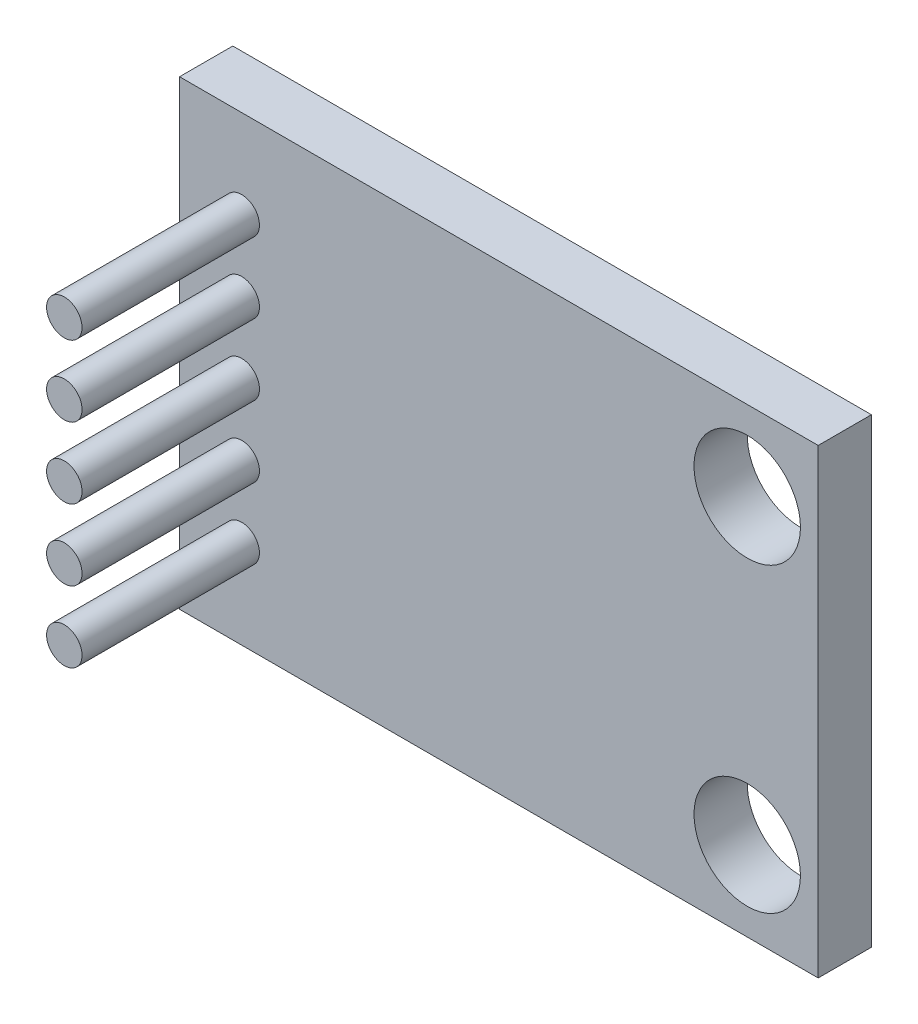
ISO-10303-21;
HEADER;
FILE_DESCRIPTION(('STEP AP214'),'2;1');
FILE_NAME('part.step','',(''),(''),'','','');
FILE_SCHEMA(('AUTOMOTIVE_DESIGN { 1 0 10303 214 1 1 1 1 }'));
ENDSEC;
DATA;
#1=APPLICATION_CONTEXT('core data for automotive mechanical design processes');
#2=APPLICATION_PROTOCOL_DEFINITION('international standard','automotive_design',2000,#1);
#3=PRODUCT_CONTEXT('',#1,'mechanical');
#4=PRODUCT('Part','Part','',(#3));
#5=PRODUCT_RELATED_PRODUCT_CATEGORY('part','',(#4));
#6=PRODUCT_DEFINITION_FORMATION('','',#4);
#7=PRODUCT_DEFINITION_CONTEXT('part definition',#1,'design');
#8=PRODUCT_DEFINITION('design','',#6,#7);
#9=PRODUCT_DEFINITION_SHAPE('','',#8);
#10=(LENGTH_UNIT() NAMED_UNIT(*) SI_UNIT(.MILLI.,.METRE.));
#11=(NAMED_UNIT(*) PLANE_ANGLE_UNIT() SI_UNIT($,.RADIAN.));
#12=(NAMED_UNIT(*) SI_UNIT($,.STERADIAN.) SOLID_ANGLE_UNIT());
#13=UNCERTAINTY_MEASURE_WITH_UNIT(LENGTH_MEASURE(1.E-05),#10,'distance_accuracy_value','');
#14=(GEOMETRIC_REPRESENTATION_CONTEXT(3) GLOBAL_UNCERTAINTY_ASSIGNED_CONTEXT((#13)) GLOBAL_UNIT_ASSIGNED_CONTEXT((#10,
#11,#12)) REPRESENTATION_CONTEXT('',''));
#15=CARTESIAN_POINT('',(0.,0.,0.));
#16=DIRECTION('',(0.,0.,1.));
#17=DIRECTION('',(1.,0.,0.));
#18=AXIS2_PLACEMENT_3D('',#15,#16,#17);
#19=CARTESIAN_POINT('',(156.583059713969,59.807197021668,1.5));
#20=DIRECTION('',(1.,0.,0.));
#21=DIRECTION('',(0.,0.,-1.));
#22=AXIS2_PLACEMENT_3D('',#19,#20,#21);
#23=PLANE('',#22);
#24=DIRECTION('',(0.,-1.,0.));
#25=VECTOR('',#24,1.);
#26=CARTESIAN_POINT('',(156.583059713969,59.807197021668,0.));
#27=LINE('',#26,#25);
#28=CARTESIAN_POINT('',(156.583059713969,59.807197021668,0.));
#29=VERTEX_POINT('',#28);
#30=CARTESIAN_POINT('',(156.583059713969,46.807197021668,0.));
#31=VERTEX_POINT('',#30);
#32=EDGE_CURVE('E98',#29,#31,#27,.T.);
#33=ORIENTED_EDGE('',*,*,#32,.T.);
#34=DIRECTION('',(0.,0.,-1.));
#35=VECTOR('',#34,1.);
#36=CARTESIAN_POINT('',(156.583059713969,46.807197021668,1.5));
#37=LINE('',#36,#35);
#38=CARTESIAN_POINT('',(156.583059713969,46.807197021668,1.5));
#39=VERTEX_POINT('',#38);
#40=EDGE_CURVE('E11',#39,#31,#37,.T.);
#41=ORIENTED_EDGE('',*,*,#40,.F.);
#42=DIRECTION('',(0.,-1.,0.));
#43=VECTOR('',#42,1.);
#44=CARTESIAN_POINT('',(156.583059713969,59.807197021668,1.5));
#45=LINE('',#44,#43);
#46=CARTESIAN_POINT('',(156.583059713969,59.807197021668,1.5));
#47=VERTEX_POINT('',#46);
#48=EDGE_CURVE('E85',#47,#39,#45,.T.);
#49=ORIENTED_EDGE('',*,*,#48,.F.);
#50=DIRECTION('',(0.,0.,-1.));
#51=VECTOR('',#50,1.);
#52=CARTESIAN_POINT('',(156.583059713969,59.807197021668,1.5));
#53=LINE('',#52,#51);
#54=EDGE_CURVE('E94',#47,#29,#53,.T.);
#55=ORIENTED_EDGE('',*,*,#54,.T.);
#56=EDGE_LOOP('',(#33,#41,#49,#55));
#57=FACE_BOUND('',#56,.T.);
#58=ADVANCED_FACE('F32',(#57),#23,.F.);
#59=CARTESIAN_POINT('',(156.583059713969,46.807197021668,1.5));
#60=DIRECTION('',(0.,1.,0.));
#61=DIRECTION('',(0.,0.,1.));
#62=AXIS2_PLACEMENT_3D('',#59,#60,#61);
#63=PLANE('',#62);
#64=DIRECTION('',(1.,0.,0.));
#65=VECTOR('',#64,1.);
#66=CARTESIAN_POINT('',(156.583059713969,46.807197021668,0.));
#67=LINE('',#66,#65);
#68=CARTESIAN_POINT('',(174.583059713969,46.807197021668,0.));
#69=VERTEX_POINT('',#68);
#70=EDGE_CURVE('E89',#31,#69,#67,.T.);
#71=ORIENTED_EDGE('',*,*,#70,.T.);
#72=DIRECTION('',(0.,0.,-1.));
#73=VECTOR('',#72,1.);
#74=CARTESIAN_POINT('',(174.583059713969,46.807197021668,1.5));
#75=LINE('',#74,#73);
#76=CARTESIAN_POINT('',(174.583059713969,46.807197021668,1.5));
#77=VERTEX_POINT('',#76);
#78=EDGE_CURVE('E41',#77,#69,#75,.T.);
#79=ORIENTED_EDGE('',*,*,#78,.F.);
#80=DIRECTION('',(1.,0.,0.));
#81=VECTOR('',#80,1.);
#82=CARTESIAN_POINT('',(156.583059713969,46.807197021668,1.5));
#83=LINE('',#82,#81);
#84=EDGE_CURVE('E80',#39,#77,#83,.T.);
#85=ORIENTED_EDGE('',*,*,#84,.F.);
#86=ORIENTED_EDGE('',*,*,#40,.T.);
#87=EDGE_LOOP('',(#71,#79,#85,#86));
#88=FACE_BOUND('',#87,.T.);
#89=ADVANCED_FACE('F88',(#88),#63,.F.);
#90=CARTESIAN_POINT('',(174.583059713969,59.807197021668,1.5));
#91=DIRECTION('',(-1.,0.,0.));
#92=DIRECTION('',(0.,0.,1.));
#93=AXIS2_PLACEMENT_3D('',#90,#91,#92);
#94=PLANE('',#93);
#95=DIRECTION('',(0.,1.,0.));
#96=VECTOR('',#95,1.);
#97=CARTESIAN_POINT('',(174.583059713969,59.807197021668,0.));
#98=LINE('',#97,#96);
#99=CARTESIAN_POINT('',(174.583059713969,59.807197021668,0.));
#100=VERTEX_POINT('',#99);
#101=EDGE_CURVE('E67',#69,#100,#98,.T.);
#102=ORIENTED_EDGE('',*,*,#101,.T.);
#103=DIRECTION('',(0.,0.,-1.));
#104=VECTOR('',#103,1.);
#105=CARTESIAN_POINT('',(174.583059713969,59.807197021668,1.5));
#106=LINE('',#105,#104);
#107=CARTESIAN_POINT('',(174.583059713969,59.807197021668,1.5));
#108=VERTEX_POINT('',#107);
#109=EDGE_CURVE('E90',#108,#100,#106,.T.);
#110=ORIENTED_EDGE('',*,*,#109,.F.);
#111=DIRECTION('',(0.,1.,0.));
#112=VECTOR('',#111,1.);
#113=CARTESIAN_POINT('',(174.583059713969,59.807197021668,1.5));
#114=LINE('',#113,#112);
#115=EDGE_CURVE('E83',#77,#108,#114,.T.);
#116=ORIENTED_EDGE('',*,*,#115,.F.);
#117=ORIENTED_EDGE('',*,*,#78,.T.);
#118=EDGE_LOOP('',(#102,#110,#116,#117));
#119=FACE_BOUND('',#118,.T.);
#120=ADVANCED_FACE('F92',(#119),#94,.F.);
#121=CARTESIAN_POINT('',(156.583059713969,59.807197021668,1.5));
#122=DIRECTION('',(0.,-1.,0.));
#123=DIRECTION('',(0.,0.,-1.));
#124=AXIS2_PLACEMENT_3D('',#121,#122,#123);
#125=PLANE('',#124);
#126=DIRECTION('',(-1.,0.,0.));
#127=VECTOR('',#126,1.);
#128=CARTESIAN_POINT('',(156.583059713969,59.807197021668,0.));
#129=LINE('',#128,#127);
#130=EDGE_CURVE('E73',#100,#29,#129,.T.);
#131=ORIENTED_EDGE('',*,*,#130,.T.);
#132=ORIENTED_EDGE('',*,*,#54,.F.);
#133=DIRECTION('',(-1.,0.,0.));
#134=VECTOR('',#133,1.);
#135=CARTESIAN_POINT('',(156.583059713969,59.807197021668,1.5));
#136=LINE('',#135,#134);
#137=EDGE_CURVE('E50',#108,#47,#136,.T.);
#138=ORIENTED_EDGE('',*,*,#137,.F.);
#139=ORIENTED_EDGE('',*,*,#109,.T.);
#140=EDGE_LOOP('',(#131,#132,#138,#139));
#141=FACE_BOUND('',#140,.T.);
#142=ADVANCED_FACE('F154',(#141),#125,.F.);
#143=CARTESIAN_POINT('',(0.,0.,1.5));
#144=DIRECTION('',(0.,0.,1.));
#145=DIRECTION('',(1.,0.,0.));
#146=AXIS2_PLACEMENT_3D('',#143,#144,#145);
#147=PLANE('',#146);
#148=CARTESIAN_POINT('',(172.583059713969,57.557197021668,1.5));
#149=DIRECTION('',(0.,0.,1.));
#150=DIRECTION('',(1.,0.,0.));
#151=AXIS2_PLACEMENT_3D('',#148,#149,#150);
#152=CIRCLE('',#151,1.5);
#153=CARTESIAN_POINT('',(174.083059713969,57.557197021668,1.5));
#154=VERTEX_POINT('',#153);
#155=EDGE_CURVE('E108',#154,#154,#152,.T.);
#156=ORIENTED_EDGE('',*,*,#155,.F.);
#157=EDGE_LOOP('',(#156));
#158=FACE_BOUND('',#157,.T.);
#159=CARTESIAN_POINT('',(172.583059713969,49.057197021668,1.5));
#160=DIRECTION('',(0.,0.,1.));
#161=DIRECTION('',(-1.,0.,0.));
#162=AXIS2_PLACEMENT_3D('',#159,#160,#161);
#163=CIRCLE('',#162,1.5);
#164=CARTESIAN_POINT('',(171.083059713969,49.057197021668,1.5));
#165=VERTEX_POINT('',#164);
#166=EDGE_CURVE('E114',#165,#165,#163,.T.);
#167=ORIENTED_EDGE('',*,*,#166,.F.);
#168=EDGE_LOOP('',(#167));
#169=FACE_BOUND('',#168,.T.);
#170=CARTESIAN_POINT('',(158.334176002424,49.307197021668,1.5));
#171=DIRECTION('',(0.,0.,1.));
#172=DIRECTION('',(1.,0.,0.));
#173=AXIS2_PLACEMENT_3D('',#170,#171,#172);
#174=CIRCLE('',#173,0.499999999999999);
#175=CARTESIAN_POINT('',(158.834176002424,49.307197021668,1.5));
#176=VERTEX_POINT('',#175);
#177=EDGE_CURVE('E112',#176,#176,#174,.T.);
#178=ORIENTED_EDGE('',*,*,#177,.F.);
#179=EDGE_LOOP('',(#178));
#180=FACE_BOUND('',#179,.T.);
#181=CARTESIAN_POINT('',(158.334176002424,51.307197021668,1.5));
#182=DIRECTION('',(0.,0.,1.));
#183=DIRECTION('',(1.,0.,0.));
#184=AXIS2_PLACEMENT_3D('',#181,#182,#183);
#185=CIRCLE('',#184,0.499999999999999);
#186=CARTESIAN_POINT('',(158.834176002424,51.307197021668,1.5));
#187=VERTEX_POINT('',#186);
#188=EDGE_CURVE('E124',#187,#187,#185,.T.);
#189=ORIENTED_EDGE('',*,*,#188,.F.);
#190=EDGE_LOOP('',(#189));
#191=FACE_BOUND('',#190,.T.);
#192=CARTESIAN_POINT('',(158.334176002424,57.307197021668,1.5));
#193=DIRECTION('',(0.,0.,1.));
#194=DIRECTION('',(1.,0.,0.));
#195=AXIS2_PLACEMENT_3D('',#192,#193,#194);
#196=CIRCLE('',#195,0.499999999999999);
#197=CARTESIAN_POINT('',(158.834176002424,57.307197021668,1.5));
#198=VERTEX_POINT('',#197);
#199=EDGE_CURVE('E130',#198,#198,#196,.T.);
#200=ORIENTED_EDGE('',*,*,#199,.F.);
#201=EDGE_LOOP('',(#200));
#202=FACE_BOUND('',#201,.T.);
#203=CARTESIAN_POINT('',(158.334176002424,55.307197021668,1.5));
#204=DIRECTION('',(0.,0.,1.));
#205=DIRECTION('',(1.,0.,0.));
#206=AXIS2_PLACEMENT_3D('',#203,#204,#205);
#207=CIRCLE('',#206,0.499999999999999);
#208=CARTESIAN_POINT('',(158.834176002424,55.307197021668,1.5));
#209=VERTEX_POINT('',#208);
#210=EDGE_CURVE('E136',#209,#209,#207,.T.);
#211=ORIENTED_EDGE('',*,*,#210,.F.);
#212=EDGE_LOOP('',(#211));
#213=FACE_BOUND('',#212,.T.);
#214=CARTESIAN_POINT('',(158.334176002424,53.307197021668,1.5));
#215=DIRECTION('',(0.,0.,1.));
#216=DIRECTION('',(1.,0.,0.));
#217=AXIS2_PLACEMENT_3D('',#214,#215,#216);
#218=CIRCLE('',#217,0.499999999999999);
#219=CARTESIAN_POINT('',(158.834176002424,53.307197021668,1.5));
#220=VERTEX_POINT('',#219);
#221=EDGE_CURVE('E142',#220,#220,#218,.T.);
#222=ORIENTED_EDGE('',*,*,#221,.F.);
#223=EDGE_LOOP('',(#222));
#224=FACE_BOUND('',#223,.T.);
#225=ORIENTED_EDGE('',*,*,#48,.T.);
#226=ORIENTED_EDGE('',*,*,#84,.T.);
#227=ORIENTED_EDGE('',*,*,#115,.T.);
#228=ORIENTED_EDGE('',*,*,#137,.T.);
#229=EDGE_LOOP('',(#225,#226,#227,#228));
#230=FACE_BOUND('',#229,.T.);
#231=ADVANCED_FACE('F81',(#158,#169,#180,#191,#202,#213,#224,#230),#147,.T.);
#232=CARTESIAN_POINT('',(0.,0.,0.));
#233=DIRECTION('',(0.,0.,1.));
#234=DIRECTION('',(1.,0.,0.));
#235=AXIS2_PLACEMENT_3D('',#232,#233,#234);
#236=PLANE('',#235);
#237=CARTESIAN_POINT('',(172.583059713969,57.557197021668,0.));
#238=DIRECTION('',(0.,0.,1.));
#239=DIRECTION('',(1.,0.,0.));
#240=AXIS2_PLACEMENT_3D('',#237,#238,#239);
#241=CIRCLE('',#240,1.5);
#242=CARTESIAN_POINT('',(174.083059713969,57.557197021668,0.));
#243=VERTEX_POINT('',#242);
#244=EDGE_CURVE('E35',#243,#243,#241,.T.);
#245=ORIENTED_EDGE('',*,*,#244,.T.);
#246=EDGE_LOOP('',(#245));
#247=FACE_BOUND('',#246,.T.);
#248=CARTESIAN_POINT('',(172.583059713969,49.057197021668,0.));
#249=DIRECTION('',(0.,0.,1.));
#250=DIRECTION('',(1.,0.,0.));
#251=AXIS2_PLACEMENT_3D('',#248,#249,#250);
#252=CIRCLE('',#251,1.5);
#253=CARTESIAN_POINT('',(174.083059713969,49.057197021668,0.));
#254=VERTEX_POINT('',#253);
#255=EDGE_CURVE('E106',#254,#254,#252,.T.);
#256=ORIENTED_EDGE('',*,*,#255,.T.);
#257=EDGE_LOOP('',(#256));
#258=FACE_BOUND('',#257,.T.);
#259=ORIENTED_EDGE('',*,*,#32,.F.);
#260=ORIENTED_EDGE('',*,*,#130,.F.);
#261=ORIENTED_EDGE('',*,*,#101,.F.);
#262=ORIENTED_EDGE('',*,*,#70,.F.);
#263=EDGE_LOOP('',(#259,#260,#261,#262));
#264=FACE_BOUND('',#263,.T.);
#265=ADVANCED_FACE('F153',(#247,#258,#264),#236,.F.);
#266=CARTESIAN_POINT('',(158.334176002424,53.307197021668,6.5));
#267=DIRECTION('',(0.,0.,-1.));
#268=DIRECTION('',(-1.,0.,0.));
#269=AXIS2_PLACEMENT_3D('',#266,#267,#268);
#270=CYLINDRICAL_SURFACE('',#269,0.499999999999999);
#271=CARTESIAN_POINT('',(158.334176002424,53.307197021668,6.5));
#272=DIRECTION('',(0.,0.,1.));
#273=DIRECTION('',(1.,0.,0.));
#274=AXIS2_PLACEMENT_3D('',#271,#272,#273);
#275=CIRCLE('',#274,0.499999999999999);
#276=CARTESIAN_POINT('',(158.834176002424,53.307197021668,6.5));
#277=VERTEX_POINT('',#276);
#278=EDGE_CURVE('E101',#277,#277,#275,.T.);
#279=ORIENTED_EDGE('',*,*,#278,.F.);
#280=EDGE_LOOP('',(#279));
#281=FACE_BOUND('',#280,.T.);
#282=ORIENTED_EDGE('',*,*,#221,.T.);
#283=EDGE_LOOP('',(#282));
#284=FACE_BOUND('',#283,.T.);
#285=ADVANCED_FACE('F150',(#281,#284),#270,.T.);
#286=CARTESIAN_POINT('',(158.334176002424,53.307197021668,6.5));
#287=DIRECTION('',(0.,0.,1.));
#288=DIRECTION('',(1.,0.,0.));
#289=AXIS2_PLACEMENT_3D('',#286,#287,#288);
#290=PLANE('',#289);
#291=ORIENTED_EDGE('',*,*,#278,.T.);
#292=EDGE_LOOP('',(#291));
#293=FACE_BOUND('',#292,.T.);
#294=ADVANCED_FACE('F193',(#293),#290,.T.);
#295=CARTESIAN_POINT('',(158.334176002424,55.307197021668,6.5));
#296=DIRECTION('',(0.,0.,-1.));
#297=DIRECTION('',(-1.,0.,0.));
#298=AXIS2_PLACEMENT_3D('',#295,#296,#297);
#299=CYLINDRICAL_SURFACE('',#298,0.499999999999999);
#300=CARTESIAN_POINT('',(158.334176002424,55.307197021668,6.5));
#301=DIRECTION('',(0.,0.,1.));
#302=DIRECTION('',(1.,0.,0.));
#303=AXIS2_PLACEMENT_3D('',#300,#301,#302);
#304=CIRCLE('',#303,0.499999999999999);
#305=CARTESIAN_POINT('',(158.834176002424,55.307197021668,6.5));
#306=VERTEX_POINT('',#305);
#307=EDGE_CURVE('E139',#306,#306,#304,.T.);
#308=ORIENTED_EDGE('',*,*,#307,.F.);
#309=EDGE_LOOP('',(#308));
#310=FACE_BOUND('',#309,.T.);
#311=ORIENTED_EDGE('',*,*,#210,.T.);
#312=EDGE_LOOP('',(#311));
#313=FACE_BOUND('',#312,.T.);
#314=ADVANCED_FACE('F203',(#310,#313),#299,.T.);
#315=CARTESIAN_POINT('',(158.334176002424,55.307197021668,6.5));
#316=DIRECTION('',(0.,0.,1.));
#317=DIRECTION('',(1.,0.,0.));
#318=AXIS2_PLACEMENT_3D('',#315,#316,#317);
#319=PLANE('',#318);
#320=ORIENTED_EDGE('',*,*,#307,.T.);
#321=EDGE_LOOP('',(#320));
#322=FACE_BOUND('',#321,.T.);
#323=ADVANCED_FACE('F213',(#322),#319,.T.);
#324=CARTESIAN_POINT('',(158.334176002424,57.307197021668,6.5));
#325=DIRECTION('',(0.,0.,-1.));
#326=DIRECTION('',(-1.,0.,0.));
#327=AXIS2_PLACEMENT_3D('',#324,#325,#326);
#328=CYLINDRICAL_SURFACE('',#327,0.499999999999999);
#329=CARTESIAN_POINT('',(158.334176002424,57.307197021668,6.5));
#330=DIRECTION('',(0.,0.,1.));
#331=DIRECTION('',(1.,0.,0.));
#332=AXIS2_PLACEMENT_3D('',#329,#330,#331);
#333=CIRCLE('',#332,0.499999999999999);
#334=CARTESIAN_POINT('',(158.834176002424,57.307197021668,6.5));
#335=VERTEX_POINT('',#334);
#336=EDGE_CURVE('E133',#335,#335,#333,.T.);
#337=ORIENTED_EDGE('',*,*,#336,.F.);
#338=EDGE_LOOP('',(#337));
#339=FACE_BOUND('',#338,.T.);
#340=ORIENTED_EDGE('',*,*,#199,.T.);
#341=EDGE_LOOP('',(#340));
#342=FACE_BOUND('',#341,.T.);
#343=ADVANCED_FACE('F223',(#339,#342),#328,.T.);
#344=CARTESIAN_POINT('',(158.334176002424,57.307197021668,6.5));
#345=DIRECTION('',(0.,0.,1.));
#346=DIRECTION('',(1.,0.,0.));
#347=AXIS2_PLACEMENT_3D('',#344,#345,#346);
#348=PLANE('',#347);
#349=ORIENTED_EDGE('',*,*,#336,.T.);
#350=EDGE_LOOP('',(#349));
#351=FACE_BOUND('',#350,.T.);
#352=ADVANCED_FACE('F233',(#351),#348,.T.);
#353=CARTESIAN_POINT('',(158.334176002424,51.307197021668,6.5));
#354=DIRECTION('',(0.,0.,-1.));
#355=DIRECTION('',(-1.,0.,0.));
#356=AXIS2_PLACEMENT_3D('',#353,#354,#355);
#357=CYLINDRICAL_SURFACE('',#356,0.499999999999999);
#358=CARTESIAN_POINT('',(158.334176002424,51.307197021668,6.5));
#359=DIRECTION('',(0.,0.,1.));
#360=DIRECTION('',(1.,0.,0.));
#361=AXIS2_PLACEMENT_3D('',#358,#359,#360);
#362=CIRCLE('',#361,0.499999999999999);
#363=CARTESIAN_POINT('',(158.834176002424,51.307197021668,6.5));
#364=VERTEX_POINT('',#363);
#365=EDGE_CURVE('E127',#364,#364,#362,.T.);
#366=ORIENTED_EDGE('',*,*,#365,.F.);
#367=EDGE_LOOP('',(#366));
#368=FACE_BOUND('',#367,.T.);
#369=ORIENTED_EDGE('',*,*,#188,.T.);
#370=EDGE_LOOP('',(#369));
#371=FACE_BOUND('',#370,.T.);
#372=ADVANCED_FACE('F243',(#368,#371),#357,.T.);
#373=CARTESIAN_POINT('',(158.334176002424,51.307197021668,6.5));
#374=DIRECTION('',(0.,0.,1.));
#375=DIRECTION('',(1.,0.,0.));
#376=AXIS2_PLACEMENT_3D('',#373,#374,#375);
#377=PLANE('',#376);
#378=ORIENTED_EDGE('',*,*,#365,.T.);
#379=EDGE_LOOP('',(#378));
#380=FACE_BOUND('',#379,.T.);
#381=ADVANCED_FACE('F253',(#380),#377,.T.);
#382=CARTESIAN_POINT('',(158.334176002424,49.307197021668,6.5));
#383=DIRECTION('',(0.,0.,-1.));
#384=DIRECTION('',(-1.,0.,0.));
#385=AXIS2_PLACEMENT_3D('',#382,#383,#384);
#386=CYLINDRICAL_SURFACE('',#385,0.499999999999999);
#387=CARTESIAN_POINT('',(158.334176002424,49.307197021668,6.5));
#388=DIRECTION('',(0.,0.,1.));
#389=DIRECTION('',(1.,0.,0.));
#390=AXIS2_PLACEMENT_3D('',#387,#388,#389);
#391=CIRCLE('',#390,0.499999999999999);
#392=CARTESIAN_POINT('',(158.834176002424,49.307197021668,6.5));
#393=VERTEX_POINT('',#392);
#394=EDGE_CURVE('E121',#393,#393,#391,.T.);
#395=ORIENTED_EDGE('',*,*,#394,.F.);
#396=EDGE_LOOP('',(#395));
#397=FACE_BOUND('',#396,.T.);
#398=ORIENTED_EDGE('',*,*,#177,.T.);
#399=EDGE_LOOP('',(#398));
#400=FACE_BOUND('',#399,.T.);
#401=ADVANCED_FACE('F263',(#397,#400),#386,.T.);
#402=CARTESIAN_POINT('',(158.334176002424,49.307197021668,6.5));
#403=DIRECTION('',(0.,0.,1.));
#404=DIRECTION('',(1.,0.,0.));
#405=AXIS2_PLACEMENT_3D('',#402,#403,#404);
#406=PLANE('',#405);
#407=ORIENTED_EDGE('',*,*,#394,.T.);
#408=EDGE_LOOP('',(#407));
#409=FACE_BOUND('',#408,.T.);
#410=ADVANCED_FACE('F273',(#409),#406,.T.);
#411=CARTESIAN_POINT('',(172.583059713969,49.057197021668,-6.24264068711927));
#412=DIRECTION('',(0.,0.,1.));
#413=DIRECTION('',(1.,0.,0.));
#414=AXIS2_PLACEMENT_3D('',#411,#412,#413);
#415=CYLINDRICAL_SURFACE('',#414,1.5);
#416=ORIENTED_EDGE('',*,*,#166,.T.);
#417=EDGE_LOOP('',(#416));
#418=FACE_BOUND('',#417,.T.);
#419=ORIENTED_EDGE('',*,*,#255,.F.);
#420=EDGE_LOOP('',(#419));
#421=FACE_BOUND('',#420,.T.);
#422=ADVANCED_FACE('F282',(#418,#421),#415,.F.);
#423=CARTESIAN_POINT('',(172.583059713969,57.557197021668,-6.24264068711927));
#424=DIRECTION('',(0.,0.,1.));
#425=DIRECTION('',(1.,0.,0.));
#426=AXIS2_PLACEMENT_3D('',#423,#424,#425);
#427=CYLINDRICAL_SURFACE('',#426,1.5);
#428=ORIENTED_EDGE('',*,*,#155,.T.);
#429=EDGE_LOOP('',(#428));
#430=FACE_BOUND('',#429,.T.);
#431=ORIENTED_EDGE('',*,*,#244,.F.);
#432=EDGE_LOOP('',(#431));
#433=FACE_BOUND('',#432,.T.);
#434=ADVANCED_FACE('F301',(#430,#433),#427,.F.);
#435=CLOSED_SHELL('',(#58,#89,#120,#142,#231,#265,#285,#294,#314,#323,#343,#352,#372,#381,#401,
#410,#422,#434));
#436=MANIFOLD_SOLID_BREP('B2',#435);
#437=ADVANCED_BREP_SHAPE_REPRESENTATION('',(#18,#436),#14);
#438=SHAPE_DEFINITION_REPRESENTATION(#9,#437);
ENDSEC;
END-ISO-10303-21;
